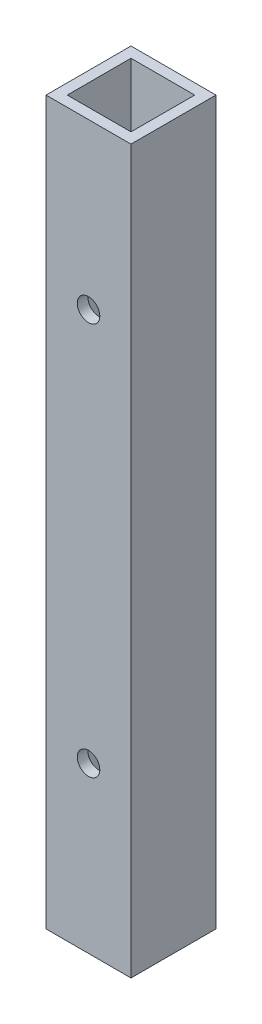
ISO-10303-21;
HEADER;
FILE_DESCRIPTION(('STEP AP214'),'2;1');
FILE_NAME('part.step','',(''),(''),'','','');
FILE_SCHEMA(('AUTOMOTIVE_DESIGN { 1 0 10303 214 1 1 1 1 }'));
ENDSEC;
DATA;
#1=APPLICATION_CONTEXT('core data for automotive mechanical design processes');
#2=APPLICATION_PROTOCOL_DEFINITION('international standard','automotive_design',2000,#1);
#3=PRODUCT_CONTEXT('',#1,'mechanical');
#4=PRODUCT('Part','Part','',(#3));
#5=PRODUCT_RELATED_PRODUCT_CATEGORY('part','',(#4));
#6=PRODUCT_DEFINITION_FORMATION('','',#4);
#7=PRODUCT_DEFINITION_CONTEXT('part definition',#1,'design');
#8=PRODUCT_DEFINITION('design','',#6,#7);
#9=PRODUCT_DEFINITION_SHAPE('','',#8);
#10=(LENGTH_UNIT() NAMED_UNIT(*) SI_UNIT(.MILLI.,.METRE.));
#11=(NAMED_UNIT(*) PLANE_ANGLE_UNIT() SI_UNIT($,.RADIAN.));
#12=(NAMED_UNIT(*) SI_UNIT($,.STERADIAN.) SOLID_ANGLE_UNIT());
#13=UNCERTAINTY_MEASURE_WITH_UNIT(LENGTH_MEASURE(1.E-05),#10,'distance_accuracy_value','');
#14=(GEOMETRIC_REPRESENTATION_CONTEXT(3) GLOBAL_UNCERTAINTY_ASSIGNED_CONTEXT((#13)) GLOBAL_UNIT_ASSIGNED_CONTEXT((#10,
#11,#12)) REPRESENTATION_CONTEXT('',''));
#15=CARTESIAN_POINT('',(0.,0.,0.));
#16=DIRECTION('',(0.,0.,1.));
#17=DIRECTION('',(1.,0.,0.));
#18=AXIS2_PLACEMENT_3D('',#15,#16,#17);
#19=CARTESIAN_POINT('',(-190.5,266.7,609.6));
#20=DIRECTION('',(0.,-1.,0.));
#21=DIRECTION('',(0.,0.,-1.));
#22=AXIS2_PLACEMENT_3D('',#19,#20,#21);
#23=PLANE('',#22);
#24=DIRECTION('',(-1.,0.,0.));
#25=VECTOR('',#24,1.);
#26=CARTESIAN_POINT('',(-190.5,266.7,558.8));
#27=LINE('',#26,#25);
#28=CARTESIAN_POINT('',(-165.1,266.7,558.8));
#29=VERTEX_POINT('',#28);
#30=CARTESIAN_POINT('',(-215.9,266.7,558.8));
#31=VERTEX_POINT('',#30);
#32=EDGE_CURVE('E155',#29,#31,#27,.T.);
#33=ORIENTED_EDGE('',*,*,#32,.T.);
#34=DIRECTION('',(0.,0.,-1.));
#35=VECTOR('',#34,1.);
#36=CARTESIAN_POINT('',(-215.9,266.7,609.6));
#37=LINE('',#36,#35);
#38=CARTESIAN_POINT('',(-215.9,266.7,609.6));
#39=VERTEX_POINT('',#38);
#40=EDGE_CURVE('E164',#39,#31,#37,.T.);
#41=ORIENTED_EDGE('',*,*,#40,.F.);
#42=DIRECTION('',(-1.,0.,0.));
#43=VECTOR('',#42,1.);
#44=CARTESIAN_POINT('',(-190.5,266.7,609.6));
#45=LINE('',#44,#43);
#46=CARTESIAN_POINT('',(-165.1,266.7,609.6));
#47=VERTEX_POINT('',#46);
#48=EDGE_CURVE('E161',#47,#39,#45,.T.);
#49=ORIENTED_EDGE('',*,*,#48,.F.);
#50=DIRECTION('',(0.,0.,-1.));
#51=VECTOR('',#50,1.);
#52=CARTESIAN_POINT('',(-165.1,266.7,609.6));
#53=LINE('',#52,#51);
#54=EDGE_CURVE('E179',#47,#29,#53,.T.);
#55=ORIENTED_EDGE('',*,*,#54,.T.);
#56=EDGE_LOOP('',(#33,#41,#49,#55));
#57=FACE_BOUND('',#56,.T.);
#58=DIRECTION('',(-1.,0.,0.));
#59=VECTOR('',#58,1.);
#60=CARTESIAN_POINT('',(-190.5,266.7,565.15));
#61=LINE('',#60,#59);
#62=CARTESIAN_POINT('',(-171.45,266.7,565.15));
#63=VERTEX_POINT('',#62);
#64=CARTESIAN_POINT('',(-209.55,266.7,565.15));
#65=VERTEX_POINT('',#64);
#66=EDGE_CURVE('E120',#63,#65,#61,.T.);
#67=ORIENTED_EDGE('',*,*,#66,.F.);
#68=DIRECTION('',(0.,0.,-1.));
#69=VECTOR('',#68,1.);
#70=CARTESIAN_POINT('',(-171.45,266.7,609.6));
#71=LINE('',#70,#69);
#72=CARTESIAN_POINT('',(-171.45,266.7,603.25));
#73=VERTEX_POINT('',#72);
#74=EDGE_CURVE('E137',#73,#63,#71,.T.);
#75=ORIENTED_EDGE('',*,*,#74,.F.);
#76=DIRECTION('',(-1.,0.,0.));
#77=VECTOR('',#76,1.);
#78=CARTESIAN_POINT('',(-190.5,266.7,603.25));
#79=LINE('',#78,#77);
#80=CARTESIAN_POINT('',(-209.55,266.7,603.25));
#81=VERTEX_POINT('',#80);
#82=EDGE_CURVE('E37',#73,#81,#79,.T.);
#83=ORIENTED_EDGE('',*,*,#82,.T.);
#84=DIRECTION('',(0.,0.,-1.));
#85=VECTOR('',#84,1.);
#86=CARTESIAN_POINT('',(-209.55,266.7,609.6));
#87=LINE('',#86,#85);
#88=EDGE_CURVE('E141',#81,#65,#87,.T.);
#89=ORIENTED_EDGE('',*,*,#88,.T.);
#90=EDGE_LOOP('',(#67,#75,#83,#89));
#91=FACE_BOUND('',#90,.T.);
#92=ADVANCED_FACE('F14',(#57,#91),#23,.F.);
#93=CARTESIAN_POINT('',(-190.5,-165.1,609.6));
#94=DIRECTION('',(0.,1.,0.));
#95=DIRECTION('',(0.,0.,1.));
#96=AXIS2_PLACEMENT_3D('',#93,#94,#95);
#97=PLANE('',#96);
#98=DIRECTION('',(1.,0.,0.));
#99=VECTOR('',#98,1.);
#100=CARTESIAN_POINT('',(-190.5,-165.1,558.8));
#101=LINE('',#100,#99);
#102=CARTESIAN_POINT('',(-215.9,-165.1,558.8));
#103=VERTEX_POINT('',#102);
#104=CARTESIAN_POINT('',(-165.1,-165.1,558.8));
#105=VERTEX_POINT('',#104);
#106=EDGE_CURVE('E168',#103,#105,#101,.T.);
#107=ORIENTED_EDGE('',*,*,#106,.T.);
#108=DIRECTION('',(0.,0.,-1.));
#109=VECTOR('',#108,1.);
#110=CARTESIAN_POINT('',(-165.1,-165.1,609.6));
#111=LINE('',#110,#109);
#112=CARTESIAN_POINT('',(-165.1,-165.1,609.6));
#113=VERTEX_POINT('',#112);
#114=EDGE_CURVE('E24',#113,#105,#111,.T.);
#115=ORIENTED_EDGE('',*,*,#114,.F.);
#116=DIRECTION('',(1.,0.,0.));
#117=VECTOR('',#116,1.);
#118=CARTESIAN_POINT('',(-190.5,-165.1,609.6));
#119=LINE('',#118,#117);
#120=CARTESIAN_POINT('',(-215.9,-165.1,609.6));
#121=VERTEX_POINT('',#120);
#122=EDGE_CURVE('E154',#121,#113,#119,.T.);
#123=ORIENTED_EDGE('',*,*,#122,.F.);
#124=DIRECTION('',(0.,0.,-1.));
#125=VECTOR('',#124,1.);
#126=CARTESIAN_POINT('',(-215.9,-165.1,609.6));
#127=LINE('',#126,#125);
#128=EDGE_CURVE('E9',#121,#103,#127,.T.);
#129=ORIENTED_EDGE('',*,*,#128,.T.);
#130=EDGE_LOOP('',(#107,#115,#123,#129));
#131=FACE_BOUND('',#130,.T.);
#132=DIRECTION('',(1.,0.,0.));
#133=VECTOR('',#132,1.);
#134=CARTESIAN_POINT('',(-190.5,-165.1,565.15));
#135=LINE('',#134,#133);
#136=CARTESIAN_POINT('',(-209.55,-165.1,565.15));
#137=VERTEX_POINT('',#136);
#138=CARTESIAN_POINT('',(-171.45,-165.1,565.15));
#139=VERTEX_POINT('',#138);
#140=EDGE_CURVE('E117',#137,#139,#135,.T.);
#141=ORIENTED_EDGE('',*,*,#140,.F.);
#142=DIRECTION('',(0.,0.,-1.));
#143=VECTOR('',#142,1.);
#144=CARTESIAN_POINT('',(-209.55,-165.1,609.6));
#145=LINE('',#144,#143);
#146=CARTESIAN_POINT('',(-209.55,-165.1,603.25));
#147=VERTEX_POINT('',#146);
#148=EDGE_CURVE('E103',#147,#137,#145,.T.);
#149=ORIENTED_EDGE('',*,*,#148,.F.);
#150=DIRECTION('',(1.,0.,0.));
#151=VECTOR('',#150,1.);
#152=CARTESIAN_POINT('',(-190.5,-165.1,603.25));
#153=LINE('',#152,#151);
#154=CARTESIAN_POINT('',(-171.45,-165.1,603.25));
#155=VERTEX_POINT('',#154);
#156=EDGE_CURVE('E138',#147,#155,#153,.T.);
#157=ORIENTED_EDGE('',*,*,#156,.T.);
#158=DIRECTION('',(0.,0.,-1.));
#159=VECTOR('',#158,1.);
#160=CARTESIAN_POINT('',(-171.45,-165.1,609.6));
#161=LINE('',#160,#159);
#162=EDGE_CURVE('E113',#155,#139,#161,.T.);
#163=ORIENTED_EDGE('',*,*,#162,.T.);
#164=EDGE_LOOP('',(#141,#149,#157,#163));
#165=FACE_BOUND('',#164,.T.);
#166=ADVANCED_FACE('F125',(#131,#165),#97,.F.);
#167=CARTESIAN_POINT('',(-215.9,50.8,609.6));
#168=DIRECTION('',(1.,0.,0.));
#169=DIRECTION('',(0.,0.,-1.));
#170=AXIS2_PLACEMENT_3D('',#167,#168,#169);
#171=PLANE('',#170);
#172=DIRECTION('',(0.,-1.,0.));
#173=VECTOR('',#172,1.);
#174=CARTESIAN_POINT('',(-215.9,50.8,558.8));
#175=LINE('',#174,#173);
#176=EDGE_CURVE('E112',#31,#103,#175,.T.);
#177=ORIENTED_EDGE('',*,*,#176,.T.);
#178=ORIENTED_EDGE('',*,*,#128,.F.);
#179=DIRECTION('',(0.,-1.,0.));
#180=VECTOR('',#179,1.);
#181=CARTESIAN_POINT('',(-215.9,50.8,609.6));
#182=LINE('',#181,#180);
#183=EDGE_CURVE('E150',#39,#121,#182,.T.);
#184=ORIENTED_EDGE('',*,*,#183,.F.);
#185=ORIENTED_EDGE('',*,*,#40,.T.);
#186=EDGE_LOOP('',(#177,#178,#184,#185));
#187=FACE_BOUND('',#186,.T.);
#188=ADVANCED_FACE('F16',(#187),#171,.F.);
#189=CARTESIAN_POINT('',(-165.1,50.8,609.6));
#190=DIRECTION('',(-1.,0.,0.));
#191=DIRECTION('',(0.,0.,1.));
#192=AXIS2_PLACEMENT_3D('',#189,#190,#191);
#193=PLANE('',#192);
#194=DIRECTION('',(0.,1.,0.));
#195=VECTOR('',#194,1.);
#196=CARTESIAN_POINT('',(-165.1,50.8,558.8));
#197=LINE('',#196,#195);
#198=EDGE_CURVE('E171',#105,#29,#197,.T.);
#199=ORIENTED_EDGE('',*,*,#198,.T.);
#200=ORIENTED_EDGE('',*,*,#54,.F.);
#201=DIRECTION('',(0.,1.,0.));
#202=VECTOR('',#201,1.);
#203=CARTESIAN_POINT('',(-165.1,50.8,609.6));
#204=LINE('',#203,#202);
#205=EDGE_CURVE('E158',#113,#47,#204,.T.);
#206=ORIENTED_EDGE('',*,*,#205,.F.);
#207=ORIENTED_EDGE('',*,*,#114,.T.);
#208=EDGE_LOOP('',(#199,#200,#206,#207));
#209=FACE_BOUND('',#208,.T.);
#210=ADVANCED_FACE('F247',(#209),#193,.F.);
#211=CARTESIAN_POINT('',(-190.5,50.8,609.6));
#212=DIRECTION('',(0.,0.,1.));
#213=DIRECTION('',(1.,0.,0.));
#214=AXIS2_PLACEMENT_3D('',#211,#212,#213);
#215=PLANE('',#214);
#216=CARTESIAN_POINT('',(-190.5,-66.675,609.6));
#217=DIRECTION('',(0.,0.,1.));
#218=DIRECTION('',(1.,0.,0.));
#219=AXIS2_PLACEMENT_3D('',#216,#217,#218);
#220=CIRCLE('',#219,6.74624);
#221=CARTESIAN_POINT('',(-183.75376,-66.675,609.6));
#222=VERTEX_POINT('',#221);
#223=EDGE_CURVE('E199',#222,#222,#220,.F.);
#224=ORIENTED_EDGE('',*,*,#223,.T.);
#225=EDGE_LOOP('',(#224));
#226=FACE_BOUND('',#225,.T.);
#227=CARTESIAN_POINT('',(-190.5,168.275,609.6));
#228=DIRECTION('',(0.,0.,1.));
#229=DIRECTION('',(1.,0.,0.));
#230=AXIS2_PLACEMENT_3D('',#227,#228,#229);
#231=CIRCLE('',#230,6.74624);
#232=CARTESIAN_POINT('',(-183.75376,168.275,609.6));
#233=VERTEX_POINT('',#232);
#234=EDGE_CURVE('E122',#233,#233,#231,.F.);
#235=ORIENTED_EDGE('',*,*,#234,.T.);
#236=EDGE_LOOP('',(#235));
#237=FACE_BOUND('',#236,.T.);
#238=ORIENTED_EDGE('',*,*,#183,.T.);
#239=ORIENTED_EDGE('',*,*,#122,.T.);
#240=ORIENTED_EDGE('',*,*,#205,.T.);
#241=ORIENTED_EDGE('',*,*,#48,.T.);
#242=EDGE_LOOP('',(#238,#239,#240,#241));
#243=FACE_BOUND('',#242,.T.);
#244=ADVANCED_FACE('F249',(#226,#237,#243),#215,.T.);
#245=CARTESIAN_POINT('',(-190.5,50.8,558.8));
#246=DIRECTION('',(0.,0.,1.));
#247=DIRECTION('',(1.,0.,0.));
#248=AXIS2_PLACEMENT_3D('',#245,#246,#247);
#249=PLANE('',#248);
#250=CARTESIAN_POINT('',(-190.5,-66.675,558.8));
#251=DIRECTION('',(0.,0.,-1.));
#252=DIRECTION('',(-1.,0.,0.));
#253=AXIS2_PLACEMENT_3D('',#250,#251,#252);
#254=CIRCLE('',#253,6.74624);
#255=CARTESIAN_POINT('',(-197.24624,-66.675,558.8));
#256=VERTEX_POINT('',#255);
#257=EDGE_CURVE('E278',#256,#256,#254,.T.);
#258=ORIENTED_EDGE('',*,*,#257,.F.);
#259=EDGE_LOOP('',(#258));
#260=FACE_BOUND('',#259,.T.);
#261=CARTESIAN_POINT('',(-190.5,168.275,558.8));
#262=DIRECTION('',(0.,0.,-1.));
#263=DIRECTION('',(-1.,0.,0.));
#264=AXIS2_PLACEMENT_3D('',#261,#262,#263);
#265=CIRCLE('',#264,6.74624);
#266=CARTESIAN_POINT('',(-197.24624,168.275,558.8));
#267=VERTEX_POINT('',#266);
#268=EDGE_CURVE('E189',#267,#267,#265,.T.);
#269=ORIENTED_EDGE('',*,*,#268,.F.);
#270=EDGE_LOOP('',(#269));
#271=FACE_BOUND('',#270,.T.);
#272=ORIENTED_EDGE('',*,*,#176,.F.);
#273=ORIENTED_EDGE('',*,*,#32,.F.);
#274=ORIENTED_EDGE('',*,*,#198,.F.);
#275=ORIENTED_EDGE('',*,*,#106,.F.);
#276=EDGE_LOOP('',(#272,#273,#274,#275));
#277=FACE_BOUND('',#276,.T.);
#278=ADVANCED_FACE('F245',(#260,#271,#277),#249,.F.);
#279=CARTESIAN_POINT('',(-209.55,50.8,609.6));
#280=DIRECTION('',(1.,0.,0.));
#281=DIRECTION('',(0.,0.,-1.));
#282=AXIS2_PLACEMENT_3D('',#279,#280,#281);
#283=PLANE('',#282);
#284=DIRECTION('',(0.,-1.,0.));
#285=VECTOR('',#284,1.);
#286=CARTESIAN_POINT('',(-209.55,50.8,565.15));
#287=LINE('',#286,#285);
#288=EDGE_CURVE('E106',#65,#137,#287,.T.);
#289=ORIENTED_EDGE('',*,*,#288,.F.);
#290=ORIENTED_EDGE('',*,*,#88,.F.);
#291=DIRECTION('',(0.,-1.,0.));
#292=VECTOR('',#291,1.);
#293=CARTESIAN_POINT('',(-209.55,50.8,603.25));
#294=LINE('',#293,#292);
#295=EDGE_CURVE('E48',#81,#147,#294,.T.);
#296=ORIENTED_EDGE('',*,*,#295,.T.);
#297=ORIENTED_EDGE('',*,*,#148,.T.);
#298=EDGE_LOOP('',(#289,#290,#296,#297));
#299=FACE_BOUND('',#298,.T.);
#300=ADVANCED_FACE('F105',(#299),#283,.T.);
#301=CARTESIAN_POINT('',(-171.45,50.8,609.6));
#302=DIRECTION('',(-1.,0.,0.));
#303=DIRECTION('',(0.,0.,1.));
#304=AXIS2_PLACEMENT_3D('',#301,#302,#303);
#305=PLANE('',#304);
#306=DIRECTION('',(0.,1.,0.));
#307=VECTOR('',#306,1.);
#308=CARTESIAN_POINT('',(-171.45,50.8,565.15));
#309=LINE('',#308,#307);
#310=EDGE_CURVE('E127',#139,#63,#309,.T.);
#311=ORIENTED_EDGE('',*,*,#310,.F.);
#312=ORIENTED_EDGE('',*,*,#162,.F.);
#313=DIRECTION('',(0.,1.,0.));
#314=VECTOR('',#313,1.);
#315=CARTESIAN_POINT('',(-171.45,50.8,603.25));
#316=LINE('',#315,#314);
#317=EDGE_CURVE('E140',#155,#73,#316,.T.);
#318=ORIENTED_EDGE('',*,*,#317,.T.);
#319=ORIENTED_EDGE('',*,*,#74,.T.);
#320=EDGE_LOOP('',(#311,#312,#318,#319));
#321=FACE_BOUND('',#320,.T.);
#322=ADVANCED_FACE('F219',(#321),#305,.T.);
#323=CARTESIAN_POINT('',(-190.5,50.8,603.25));
#324=DIRECTION('',(0.,0.,1.));
#325=DIRECTION('',(1.,0.,0.));
#326=AXIS2_PLACEMENT_3D('',#323,#324,#325);
#327=PLANE('',#326);
#328=CARTESIAN_POINT('',(-190.5,-66.675,603.25));
#329=DIRECTION('',(0.,0.,1.));
#330=DIRECTION('',(1.,0.,0.));
#331=AXIS2_PLACEMENT_3D('',#328,#329,#330);
#332=CIRCLE('',#331,6.74624);
#333=CARTESIAN_POINT('',(-183.75376,-66.675,603.25));
#334=VERTEX_POINT('',#333);
#335=EDGE_CURVE('E207',#334,#334,#332,.F.);
#336=ORIENTED_EDGE('',*,*,#335,.F.);
#337=EDGE_LOOP('',(#336));
#338=FACE_BOUND('',#337,.T.);
#339=CARTESIAN_POINT('',(-190.5,168.275,603.25));
#340=DIRECTION('',(0.,0.,1.));
#341=DIRECTION('',(1.,0.,0.));
#342=AXIS2_PLACEMENT_3D('',#339,#340,#341);
#343=CIRCLE('',#342,6.74624);
#344=CARTESIAN_POINT('',(-183.75376,168.275,603.25));
#345=VERTEX_POINT('',#344);
#346=EDGE_CURVE('E188',#345,#345,#343,.F.);
#347=ORIENTED_EDGE('',*,*,#346,.F.);
#348=EDGE_LOOP('',(#347));
#349=FACE_BOUND('',#348,.T.);
#350=ORIENTED_EDGE('',*,*,#295,.F.);
#351=ORIENTED_EDGE('',*,*,#82,.F.);
#352=ORIENTED_EDGE('',*,*,#317,.F.);
#353=ORIENTED_EDGE('',*,*,#156,.F.);
#354=EDGE_LOOP('',(#350,#351,#352,#353));
#355=FACE_BOUND('',#354,.T.);
#356=ADVANCED_FACE('F221',(#338,#349,#355),#327,.F.);
#357=CARTESIAN_POINT('',(-190.5,50.8,565.15));
#358=DIRECTION('',(0.,0.,1.));
#359=DIRECTION('',(1.,0.,0.));
#360=AXIS2_PLACEMENT_3D('',#357,#358,#359);
#361=PLANE('',#360);
#362=CARTESIAN_POINT('',(-190.5,-66.675,565.15));
#363=DIRECTION('',(0.,0.,1.));
#364=DIRECTION('',(1.,0.,0.));
#365=AXIS2_PLACEMENT_3D('',#362,#363,#364);
#366=CIRCLE('',#365,6.74624);
#367=CARTESIAN_POINT('',(-183.75376,-66.675,565.15));
#368=VERTEX_POINT('',#367);
#369=EDGE_CURVE('E18',#368,#368,#366,.F.);
#370=ORIENTED_EDGE('',*,*,#369,.T.);
#371=EDGE_LOOP('',(#370));
#372=FACE_BOUND('',#371,.T.);
#373=CARTESIAN_POINT('',(-190.5,168.275,565.15));
#374=DIRECTION('',(0.,0.,1.));
#375=DIRECTION('',(1.,0.,0.));
#376=AXIS2_PLACEMENT_3D('',#373,#374,#375);
#377=CIRCLE('',#376,6.74624);
#378=CARTESIAN_POINT('',(-183.75376,168.275,565.15));
#379=VERTEX_POINT('',#378);
#380=EDGE_CURVE('E185',#379,#379,#377,.F.);
#381=ORIENTED_EDGE('',*,*,#380,.T.);
#382=EDGE_LOOP('',(#381));
#383=FACE_BOUND('',#382,.T.);
#384=ORIENTED_EDGE('',*,*,#288,.T.);
#385=ORIENTED_EDGE('',*,*,#140,.T.);
#386=ORIENTED_EDGE('',*,*,#310,.T.);
#387=ORIENTED_EDGE('',*,*,#66,.T.);
#388=EDGE_LOOP('',(#384,#385,#386,#387));
#389=FACE_BOUND('',#388,.T.);
#390=ADVANCED_FACE('F116',(#372,#383,#389),#361,.T.);
#391=CARTESIAN_POINT('',(-190.5,168.275,998.562448637452));
#392=DIRECTION('',(0.,0.,-1.));
#393=DIRECTION('',(-1.,0.,0.));
#394=AXIS2_PLACEMENT_3D('',#391,#392,#393);
#395=CYLINDRICAL_SURFACE('',#394,6.74624);
#396=ORIENTED_EDGE('',*,*,#380,.F.);
#397=EDGE_LOOP('',(#396));
#398=FACE_BOUND('',#397,.T.);
#399=ORIENTED_EDGE('',*,*,#268,.T.);
#400=EDGE_LOOP('',(#399));
#401=FACE_BOUND('',#400,.T.);
#402=ADVANCED_FACE('F230',(#398,#401),#395,.F.);
#403=ORIENTED_EDGE('',*,*,#234,.F.);
#404=EDGE_LOOP('',(#403));
#405=FACE_BOUND('',#404,.T.);
#406=ORIENTED_EDGE('',*,*,#346,.T.);
#407=EDGE_LOOP('',(#406));
#408=FACE_BOUND('',#407,.T.);
#409=ADVANCED_FACE('F300',(#405,#408),#395,.F.);
#410=CARTESIAN_POINT('',(-190.5,-66.675,998.562448637452));
#411=DIRECTION('',(0.,0.,-1.));
#412=DIRECTION('',(-1.,0.,0.));
#413=AXIS2_PLACEMENT_3D('',#410,#411,#412);
#414=CYLINDRICAL_SURFACE('',#413,6.74624);
#415=ORIENTED_EDGE('',*,*,#369,.F.);
#416=EDGE_LOOP('',(#415));
#417=FACE_BOUND('',#416,.T.);
#418=ORIENTED_EDGE('',*,*,#257,.T.);
#419=EDGE_LOOP('',(#418));
#420=FACE_BOUND('',#419,.T.);
#421=ADVANCED_FACE('F294',(#417,#420),#414,.F.);
#422=ORIENTED_EDGE('',*,*,#223,.F.);
#423=EDGE_LOOP('',(#422));
#424=FACE_BOUND('',#423,.T.);
#425=ORIENTED_EDGE('',*,*,#335,.T.);
#426=EDGE_LOOP('',(#425));
#427=FACE_BOUND('',#426,.T.);
#428=ADVANCED_FACE('F292',(#424,#427),#414,.F.);
#429=CLOSED_SHELL('',(#92,#166,#188,#210,#244,#278,#300,#322,#356,#390,#402,#409,#421,#428));
#430=MANIFOLD_SOLID_BREP('B1',#429);
#431=ADVANCED_BREP_SHAPE_REPRESENTATION('',(#18,#430),#14);
#432=SHAPE_DEFINITION_REPRESENTATION(#9,#431);
ENDSEC;
END-ISO-10303-21;
